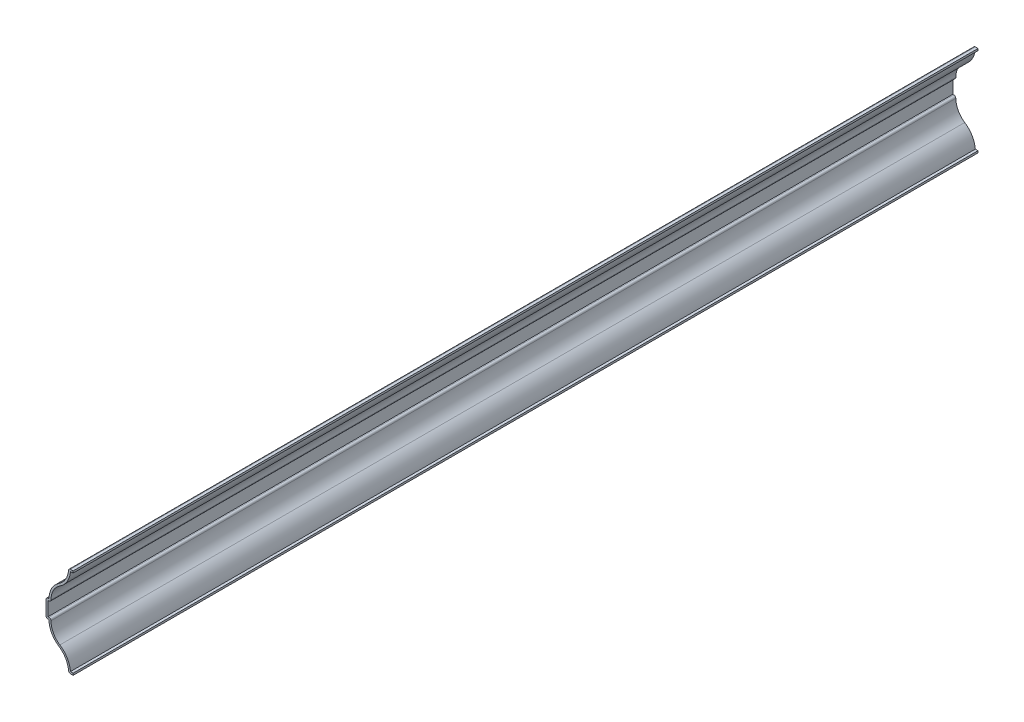
ISO-10303-21;
HEADER;
FILE_DESCRIPTION(('STEP AP214'),'2;1');
FILE_NAME('part.step','',(''),(''),'','','');
FILE_SCHEMA(('AUTOMOTIVE_DESIGN { 1 0 10303 214 1 1 1 1 }'));
ENDSEC;
DATA;
#1=APPLICATION_CONTEXT('core data for automotive mechanical design processes');
#2=APPLICATION_PROTOCOL_DEFINITION('international standard','automotive_design',2000,#1);
#3=PRODUCT_CONTEXT('',#1,'mechanical');
#4=PRODUCT('Part','Part','',(#3));
#5=PRODUCT_RELATED_PRODUCT_CATEGORY('part','',(#4));
#6=PRODUCT_DEFINITION_FORMATION('','',#4);
#7=PRODUCT_DEFINITION_CONTEXT('part definition',#1,'design');
#8=PRODUCT_DEFINITION('design','',#6,#7);
#9=PRODUCT_DEFINITION_SHAPE('','',#8);
#10=(LENGTH_UNIT() NAMED_UNIT(*) SI_UNIT(.MILLI.,.METRE.));
#11=(NAMED_UNIT(*) PLANE_ANGLE_UNIT() SI_UNIT($,.RADIAN.));
#12=(NAMED_UNIT(*) SI_UNIT($,.STERADIAN.) SOLID_ANGLE_UNIT());
#13=UNCERTAINTY_MEASURE_WITH_UNIT(LENGTH_MEASURE(1.E-05),#10,'distance_accuracy_value','');
#14=(GEOMETRIC_REPRESENTATION_CONTEXT(3) GLOBAL_UNCERTAINTY_ASSIGNED_CONTEXT((#13)) GLOBAL_UNIT_ASSIGNED_CONTEXT((#10,
#11,#12)) REPRESENTATION_CONTEXT('',''));
#15=CARTESIAN_POINT('',(0.,0.,0.));
#16=DIRECTION('',(0.,0.,1.));
#17=DIRECTION('',(1.,0.,0.));
#18=AXIS2_PLACEMENT_3D('',#15,#16,#17);
#19=CARTESIAN_POINT('',(0.,0.,-476.25));
#20=DIRECTION('',(0.,-1.,0.));
#21=DIRECTION('',(1.,0.,0.));
#22=AXIS2_PLACEMENT_3D('',#19,#20,#21);
#23=PLANE('',#22);
#24=DIRECTION('',(1.,0.,0.));
#25=VECTOR('',#24,1.);
#26=CARTESIAN_POINT('',(0.,0.,0.));
#27=LINE('',#26,#25);
#28=CARTESIAN_POINT('',(-1.4069838600404,0.,0.));
#29=VERTEX_POINT('',#28);
#30=CARTESIAN_POINT('',(0.,0.,0.));
#31=VERTEX_POINT('',#30);
#32=EDGE_CURVE('E371',#29,#31,#27,.T.);
#33=ORIENTED_EDGE('',*,*,#32,.F.);
#34=DIRECTION('',(0.,0.,1.));
#35=VECTOR('',#34,1.);
#36=CARTESIAN_POINT('',(-1.4069838600404,0.,-476.25));
#37=LINE('',#36,#35);
#38=CARTESIAN_POINT('',(-1.4069838600404,0.,-476.25));
#39=VERTEX_POINT('',#38);
#40=EDGE_CURVE('E216',#29,#39,#37,.F.);
#41=ORIENTED_EDGE('',*,*,#40,.T.);
#42=DIRECTION('',(1.,0.,0.));
#43=VECTOR('',#42,1.);
#44=CARTESIAN_POINT('',(0.,0.,-476.25));
#45=LINE('',#44,#43);
#46=CARTESIAN_POINT('',(0.,0.,-476.25));
#47=VERTEX_POINT('',#46);
#48=EDGE_CURVE('E209',#39,#47,#45,.T.);
#49=ORIENTED_EDGE('',*,*,#48,.T.);
#50=DIRECTION('',(0.,0.,1.));
#51=VECTOR('',#50,1.);
#52=CARTESIAN_POINT('',(0.,0.,-476.25));
#53=LINE('',#52,#51);
#54=EDGE_CURVE('E213',#47,#31,#53,.T.);
#55=ORIENTED_EDGE('',*,*,#54,.T.);
#56=EDGE_LOOP('',(#33,#41,#49,#55));
#57=FACE_BOUND('',#56,.T.);
#58=ADVANCED_FACE('F35',(#57),#23,.T.);
#59=CARTESIAN_POINT('',(-13.7532451923077,0.,-476.25));
#60=DIRECTION('',(0.,0.,1.));
#61=DIRECTION('',(1.,0.,0.));
#62=AXIS2_PLACEMENT_3D('',#59,#60,#61);
#63=CYLINDRICAL_SURFACE('',#62,11.3719951923077);
#64=CARTESIAN_POINT('',(-13.7532451923077,0.,-476.25));
#65=DIRECTION('',(0.,0.,-1.));
#66=DIRECTION('',(1.,0.,0.));
#67=AXIS2_PLACEMENT_3D('',#64,#65,#66);
#68=CIRCLE('',#67,11.3719951923077);
#69=CARTESIAN_POINT('',(-7.540625,9.525,-476.25));
#70=VERTEX_POINT('',#69);
#71=CARTESIAN_POINT('',(-2.41956106231221,0.932672876928384,-476.25));
#72=VERTEX_POINT('',#71);
#73=EDGE_CURVE('E233',#70,#72,#68,.T.);
#74=ORIENTED_EDGE('',*,*,#73,.T.);
#75=DIRECTION('',(0.,0.,1.));
#76=VECTOR('',#75,1.);
#77=CARTESIAN_POINT('',(-2.41956106231221,0.932672876928385,-476.25));
#78=LINE('',#77,#76);
#79=CARTESIAN_POINT('',(-2.41956106231221,0.932672876928384,0.));
#80=VERTEX_POINT('',#79);
#81=EDGE_CURVE('E242',#72,#80,#78,.T.);
#82=ORIENTED_EDGE('',*,*,#81,.T.);
#83=CARTESIAN_POINT('',(-13.7532451923077,0.,0.));
#84=DIRECTION('',(0.,0.,-1.));
#85=DIRECTION('',(1.,0.,0.));
#86=AXIS2_PLACEMENT_3D('',#83,#84,#85);
#87=CIRCLE('',#86,11.3719951923077);
#88=CARTESIAN_POINT('',(-7.540625,9.525,0.));
#89=VERTEX_POINT('',#88);
#90=EDGE_CURVE('E219',#89,#80,#87,.T.);
#91=ORIENTED_EDGE('',*,*,#90,.F.);
#92=DIRECTION('',(0.,0.,1.));
#93=VECTOR('',#92,1.);
#94=CARTESIAN_POINT('',(-7.540625,9.525,-476.25));
#95=LINE('',#94,#93);
#96=EDGE_CURVE('E246',#70,#89,#95,.T.);
#97=ORIENTED_EDGE('',*,*,#96,.F.);
#98=EDGE_LOOP('',(#74,#82,#91,#97));
#99=FACE_BOUND('',#98,.T.);
#100=ADVANCED_FACE('F448',(#99),#63,.F.);
#101=CARTESIAN_POINT('',(-1.32800480769231,19.05,-476.25));
#102=DIRECTION('',(0.,0.,1.));
#103=DIRECTION('',(1.,0.,0.));
#104=AXIS2_PLACEMENT_3D('',#101,#102,#103);
#105=CYLINDRICAL_SURFACE('',#104,11.3719951923077);
#106=CARTESIAN_POINT('',(-1.32800480769231,19.05,0.));
#107=DIRECTION('',(0.,0.,1.));
#108=DIRECTION('',(-1.,0.,0.));
#109=AXIS2_PLACEMENT_3D('',#106,#107,#108);
#110=CIRCLE('',#109,11.3719951923077);
#111=CARTESIAN_POINT('',(-12.7,19.05,0.));
#112=VERTEX_POINT('',#111);
#113=EDGE_CURVE('E325',#112,#89,#110,.T.);
#114=ORIENTED_EDGE('',*,*,#113,.F.);
#115=DIRECTION('',(0.,0.,1.));
#116=VECTOR('',#115,1.);
#117=CARTESIAN_POINT('',(-12.7,19.05,-476.25));
#118=LINE('',#117,#116);
#119=CARTESIAN_POINT('',(-12.7,19.05,-476.25));
#120=VERTEX_POINT('',#119);
#121=EDGE_CURVE('E330',#120,#112,#118,.T.);
#122=ORIENTED_EDGE('',*,*,#121,.F.);
#123=CARTESIAN_POINT('',(-1.32800480769231,19.05,-476.25));
#124=DIRECTION('',(0.,0.,1.));
#125=DIRECTION('',(-1.,0.,0.));
#126=AXIS2_PLACEMENT_3D('',#123,#124,#125);
#127=CIRCLE('',#126,11.3719951923077);
#128=EDGE_CURVE('E238',#120,#70,#127,.T.);
#129=ORIENTED_EDGE('',*,*,#128,.T.);
#130=ORIENTED_EDGE('',*,*,#96,.T.);
#131=EDGE_LOOP('',(#114,#122,#129,#130));
#132=FACE_BOUND('',#131,.T.);
#133=ADVANCED_FACE('F453',(#132),#105,.T.);
#134=CARTESIAN_POINT('',(-12.7,19.05,-476.25));
#135=DIRECTION('',(0.,-1.,0.));
#136=DIRECTION('',(0.,0.,-1.));
#137=AXIS2_PLACEMENT_3D('',#134,#135,#136);
#138=PLANE('',#137);
#139=DIRECTION('',(1.,0.,0.));
#140=VECTOR('',#139,1.);
#141=CARTESIAN_POINT('',(-12.7,19.05,0.));
#142=LINE('',#141,#140);
#143=CARTESIAN_POINT('',(-13.2715,19.05,0.));
#144=VERTEX_POINT('',#143);
#145=EDGE_CURVE('E323',#144,#112,#142,.T.);
#146=ORIENTED_EDGE('',*,*,#145,.F.);
#147=DIRECTION('',(0.,0.,1.));
#148=VECTOR('',#147,1.);
#149=CARTESIAN_POINT('',(-13.2715,19.05,-476.25));
#150=LINE('',#149,#148);
#151=CARTESIAN_POINT('',(-13.2715,19.05,-476.25));
#152=VERTEX_POINT('',#151);
#153=EDGE_CURVE('E279',#144,#152,#150,.F.);
#154=ORIENTED_EDGE('',*,*,#153,.T.);
#155=DIRECTION('',(1.,0.,0.));
#156=VECTOR('',#155,1.);
#157=CARTESIAN_POINT('',(-12.7,19.05,-476.25));
#158=LINE('',#157,#156);
#159=EDGE_CURVE('E439',#152,#120,#158,.T.);
#160=ORIENTED_EDGE('',*,*,#159,.T.);
#161=ORIENTED_EDGE('',*,*,#121,.T.);
#162=EDGE_LOOP('',(#146,#154,#160,#161));
#163=FACE_BOUND('',#162,.T.);
#164=ADVANCED_FACE('F671',(#163),#138,.T.);
#165=CARTESIAN_POINT('',(-14.2875,19.05,-476.25));
#166=DIRECTION('',(-1.,0.,0.));
#167=DIRECTION('',(0.,-1.,0.));
#168=AXIS2_PLACEMENT_3D('',#165,#166,#167);
#169=PLANE('',#168);
#170=DIRECTION('',(0.,-1.,0.));
#171=VECTOR('',#170,1.);
#172=CARTESIAN_POINT('',(-14.2875,19.05,-476.25));
#173=LINE('',#172,#171);
#174=CARTESIAN_POINT('',(-14.2875,27.559,-476.25));
#175=VERTEX_POINT('',#174);
#176=CARTESIAN_POINT('',(-14.2875,20.066,-476.25));
#177=VERTEX_POINT('',#176);
#178=EDGE_CURVE('E436',#175,#177,#173,.T.);
#179=ORIENTED_EDGE('',*,*,#178,.T.);
#180=DIRECTION('',(0.,0.,1.));
#181=VECTOR('',#180,1.);
#182=CARTESIAN_POINT('',(-14.2875,20.066,-476.25));
#183=LINE('',#182,#181);
#184=CARTESIAN_POINT('',(-14.2875,20.066,0.));
#185=VERTEX_POINT('',#184);
#186=EDGE_CURVE('E276',#177,#185,#183,.T.);
#187=ORIENTED_EDGE('',*,*,#186,.T.);
#188=DIRECTION('',(0.,-1.,0.));
#189=VECTOR('',#188,1.);
#190=CARTESIAN_POINT('',(-14.2875,19.05,0.));
#191=LINE('',#190,#189);
#192=CARTESIAN_POINT('',(-14.2875,27.559,0.));
#193=VERTEX_POINT('',#192);
#194=EDGE_CURVE('E320',#193,#185,#191,.T.);
#195=ORIENTED_EDGE('',*,*,#194,.F.);
#196=DIRECTION('',(0.,0.,1.));
#197=VECTOR('',#196,1.);
#198=CARTESIAN_POINT('',(-14.2875,27.559,-476.25));
#199=LINE('',#198,#197);
#200=EDGE_CURVE('E274',#193,#175,#199,.F.);
#201=ORIENTED_EDGE('',*,*,#200,.T.);
#202=EDGE_LOOP('',(#179,#187,#195,#201));
#203=FACE_BOUND('',#202,.T.);
#204=ADVANCED_FACE('F464',(#203),#169,.T.);
#205=CARTESIAN_POINT('',(-12.7,28.575,-476.25));
#206=DIRECTION('',(0.,1.,0.));
#207=DIRECTION('',(0.,0.,1.));
#208=AXIS2_PLACEMENT_3D('',#205,#206,#207);
#209=PLANE('',#208);
#210=DIRECTION('',(-1.,0.,0.));
#211=VECTOR('',#210,1.);
#212=CARTESIAN_POINT('',(-12.7,28.575,-476.25));
#213=LINE('',#212,#211);
#214=CARTESIAN_POINT('',(-12.7,28.575,-476.25));
#215=VERTEX_POINT('',#214);
#216=CARTESIAN_POINT('',(-13.2715,28.575,-476.25));
#217=VERTEX_POINT('',#216);
#218=EDGE_CURVE('E433',#215,#217,#213,.T.);
#219=ORIENTED_EDGE('',*,*,#218,.T.);
#220=DIRECTION('',(0.,0.,1.));
#221=VECTOR('',#220,1.);
#222=CARTESIAN_POINT('',(-13.2715,28.575,-476.25));
#223=LINE('',#222,#221);
#224=CARTESIAN_POINT('',(-13.2715,28.575,0.));
#225=VERTEX_POINT('',#224);
#226=EDGE_CURVE('E281',#217,#225,#223,.T.);
#227=ORIENTED_EDGE('',*,*,#226,.T.);
#228=DIRECTION('',(-1.,0.,0.));
#229=VECTOR('',#228,1.);
#230=CARTESIAN_POINT('',(-12.7,28.575,0.));
#231=LINE('',#230,#229);
#232=CARTESIAN_POINT('',(-12.7,28.575,0.));
#233=VERTEX_POINT('',#232);
#234=EDGE_CURVE('E317',#233,#225,#231,.T.);
#235=ORIENTED_EDGE('',*,*,#234,.F.);
#236=DIRECTION('',(0.,0.,1.));
#237=VECTOR('',#236,1.);
#238=CARTESIAN_POINT('',(-12.7,28.575,-476.25));
#239=LINE('',#238,#237);
#240=EDGE_CURVE('E333',#215,#233,#239,.T.);
#241=ORIENTED_EDGE('',*,*,#240,.F.);
#242=EDGE_LOOP('',(#219,#227,#235,#241));
#243=FACE_BOUND('',#242,.T.);
#244=ADVANCED_FACE('F473',(#243),#209,.T.);
#245=CARTESIAN_POINT('',(-1.32800480769231,28.575,-476.25));
#246=DIRECTION('',(0.,0.,1.));
#247=DIRECTION('',(1.,0.,0.));
#248=AXIS2_PLACEMENT_3D('',#245,#246,#247);
#249=CYLINDRICAL_SURFACE('',#248,11.3719951923077);
#250=CARTESIAN_POINT('',(-1.32800480769231,28.575,0.));
#251=DIRECTION('',(0.,0.,1.));
#252=DIRECTION('',(1.,0.,0.));
#253=AXIS2_PLACEMENT_3D('',#250,#251,#252);
#254=CIRCLE('',#253,11.3719951923077);
#255=CARTESIAN_POINT('',(-7.540625,38.1,0.));
#256=VERTEX_POINT('',#255);
#257=EDGE_CURVE('E309',#256,#233,#254,.T.);
#258=ORIENTED_EDGE('',*,*,#257,.F.);
#259=DIRECTION('',(0.,0.,1.));
#260=VECTOR('',#259,1.);
#261=CARTESIAN_POINT('',(-7.540625,38.1,-476.25));
#262=LINE('',#261,#260);
#263=CARTESIAN_POINT('',(-7.540625,38.1,-476.25));
#264=VERTEX_POINT('',#263);
#265=EDGE_CURVE('E335',#264,#256,#262,.T.);
#266=ORIENTED_EDGE('',*,*,#265,.F.);
#267=CARTESIAN_POINT('',(-1.32800480769231,28.575,-476.25));
#268=DIRECTION('',(0.,0.,1.));
#269=DIRECTION('',(1.,0.,0.));
#270=AXIS2_PLACEMENT_3D('',#267,#268,#269);
#271=CIRCLE('',#270,11.3719951923077);
#272=EDGE_CURVE('E430',#264,#215,#271,.T.);
#273=ORIENTED_EDGE('',*,*,#272,.T.);
#274=ORIENTED_EDGE('',*,*,#240,.T.);
#275=EDGE_LOOP('',(#258,#266,#273,#274));
#276=FACE_BOUND('',#275,.T.);
#277=ADVANCED_FACE('F480',(#276),#249,.T.);
#278=CARTESIAN_POINT('',(-13.7532451923077,47.625,-476.25));
#279=DIRECTION('',(0.,0.,1.));
#280=DIRECTION('',(1.,0.,0.));
#281=AXIS2_PLACEMENT_3D('',#278,#279,#280);
#282=CYLINDRICAL_SURFACE('',#281,11.3719951923077);
#283=CARTESIAN_POINT('',(-13.7532451923077,47.625,0.));
#284=DIRECTION('',(0.,0.,-1.));
#285=DIRECTION('',(-1.,0.,0.));
#286=AXIS2_PLACEMENT_3D('',#283,#284,#285);
#287=CIRCLE('',#286,11.3719951923077);
#288=CARTESIAN_POINT('',(-2.41956106231222,46.6923271230716,0.));
#289=VERTEX_POINT('',#288);
#290=EDGE_CURVE('E307',#289,#256,#287,.T.);
#291=ORIENTED_EDGE('',*,*,#290,.F.);
#292=DIRECTION('',(0.,0.,1.));
#293=VECTOR('',#292,1.);
#294=CARTESIAN_POINT('',(-2.41956106231221,46.6923271230716,-476.25));
#295=LINE('',#294,#293);
#296=CARTESIAN_POINT('',(-2.41956106231222,46.6923271230716,-476.25));
#297=VERTEX_POINT('',#296);
#298=EDGE_CURVE('E11',#289,#297,#295,.F.);
#299=ORIENTED_EDGE('',*,*,#298,.T.);
#300=CARTESIAN_POINT('',(-13.7532451923077,47.625,-476.25));
#301=DIRECTION('',(0.,0.,-1.));
#302=DIRECTION('',(-1.,0.,0.));
#303=AXIS2_PLACEMENT_3D('',#300,#301,#302);
#304=CIRCLE('',#303,11.3719951923077);
#305=EDGE_CURVE('E428',#297,#264,#304,.T.);
#306=ORIENTED_EDGE('',*,*,#305,.T.);
#307=ORIENTED_EDGE('',*,*,#265,.T.);
#308=EDGE_LOOP('',(#291,#299,#306,#307));
#309=FACE_BOUND('',#308,.T.);
#310=ADVANCED_FACE('F482',(#309),#282,.F.);
#311=CARTESIAN_POINT('',(0.,47.625,-476.25));
#312=DIRECTION('',(0.,1.,0.));
#313=DIRECTION('',(0.,0.,1.));
#314=AXIS2_PLACEMENT_3D('',#311,#312,#313);
#315=PLANE('',#314);
#316=DIRECTION('',(-1.,0.,0.));
#317=VECTOR('',#316,1.);
#318=CARTESIAN_POINT('',(0.,47.625,-476.25));
#319=LINE('',#318,#317);
#320=CARTESIAN_POINT('',(0.,47.625,-476.25));
#321=VERTEX_POINT('',#320);
#322=CARTESIAN_POINT('',(-1.4069838600404,47.625,-476.25));
#323=VERTEX_POINT('',#322);
#324=EDGE_CURVE('E297',#321,#323,#319,.T.);
#325=ORIENTED_EDGE('',*,*,#324,.T.);
#326=DIRECTION('',(0.,0.,1.));
#327=VECTOR('',#326,1.);
#328=CARTESIAN_POINT('',(-1.4069838600404,47.625,-476.25));
#329=LINE('',#328,#327);
#330=CARTESIAN_POINT('',(-1.4069838600404,47.625,0.));
#331=VERTEX_POINT('',#330);
#332=EDGE_CURVE('E43',#323,#331,#329,.T.);
#333=ORIENTED_EDGE('',*,*,#332,.T.);
#334=DIRECTION('',(-1.,0.,0.));
#335=VECTOR('',#334,1.);
#336=CARTESIAN_POINT('',(0.,47.625,0.));
#337=LINE('',#336,#335);
#338=CARTESIAN_POINT('',(0.,47.625,0.));
#339=VERTEX_POINT('',#338);
#340=EDGE_CURVE('E295',#339,#331,#337,.T.);
#341=ORIENTED_EDGE('',*,*,#340,.F.);
#342=DIRECTION('',(0.,0.,1.));
#343=VECTOR('',#342,1.);
#344=CARTESIAN_POINT('',(0.,47.625,-476.25));
#345=LINE('',#344,#343);
#346=EDGE_CURVE('E338',#321,#339,#345,.T.);
#347=ORIENTED_EDGE('',*,*,#346,.F.);
#348=EDGE_LOOP('',(#325,#333,#341,#347));
#349=FACE_BOUND('',#348,.T.);
#350=ADVANCED_FACE('F294',(#349),#315,.T.);
#351=CARTESIAN_POINT('',(0.,47.625,-476.25));
#352=DIRECTION('',(-1.,0.,0.));
#353=DIRECTION('',(0.,0.,1.));
#354=AXIS2_PLACEMENT_3D('',#351,#352,#353);
#355=PLANE('',#354);
#356=DIRECTION('',(0.,-1.,0.));
#357=VECTOR('',#356,1.);
#358=CARTESIAN_POINT('',(0.,47.625,0.));
#359=LINE('',#358,#357);
#360=CARTESIAN_POINT('',(0.,46.609,0.));
#361=VERTEX_POINT('',#360);
#362=EDGE_CURVE('E306',#339,#361,#359,.T.);
#363=ORIENTED_EDGE('',*,*,#362,.T.);
#364=DIRECTION('',(0.,0.,1.));
#365=VECTOR('',#364,1.);
#366=CARTESIAN_POINT('',(0.,46.609,-476.25));
#367=LINE('',#366,#365);
#368=CARTESIAN_POINT('',(0.,46.609,-476.25));
#369=VERTEX_POINT('',#368);
#370=EDGE_CURVE('E340',#369,#361,#367,.T.);
#371=ORIENTED_EDGE('',*,*,#370,.F.);
#372=DIRECTION('',(0.,-1.,0.));
#373=VECTOR('',#372,1.);
#374=CARTESIAN_POINT('',(0.,47.625,-476.25));
#375=LINE('',#374,#373);
#376=EDGE_CURVE('E425',#321,#369,#375,.T.);
#377=ORIENTED_EDGE('',*,*,#376,.F.);
#378=ORIENTED_EDGE('',*,*,#346,.T.);
#379=EDGE_LOOP('',(#363,#371,#377,#378));
#380=FACE_BOUND('',#379,.T.);
#381=ADVANCED_FACE('F627',(#380),#355,.F.);
#382=CARTESIAN_POINT('',(0.,46.609,-476.25));
#383=DIRECTION('',(0.,1.,0.));
#384=DIRECTION('',(0.,0.,1.));
#385=AXIS2_PLACEMENT_3D('',#382,#383,#384);
#386=PLANE('',#385);
#387=DIRECTION('',(1.,0.,0.));
#388=VECTOR('',#387,1.);
#389=CARTESIAN_POINT('',(0.,46.609,0.));
#390=LINE('',#389,#388);
#391=CARTESIAN_POINT('',(-1.4069838600404,46.609,0.));
#392=VERTEX_POINT('',#391);
#393=EDGE_CURVE('E311',#361,#392,#390,.F.);
#394=ORIENTED_EDGE('',*,*,#393,.T.);
#395=DIRECTION('',(0.,0.,1.));
#396=VECTOR('',#395,1.);
#397=CARTESIAN_POINT('',(-1.4069838600404,46.609,-476.25));
#398=LINE('',#397,#396);
#399=CARTESIAN_POINT('',(-1.4069838600404,46.609,-476.25));
#400=VERTEX_POINT('',#399);
#401=EDGE_CURVE('E343',#400,#392,#398,.T.);
#402=ORIENTED_EDGE('',*,*,#401,.F.);
#403=DIRECTION('',(1.,0.,0.));
#404=VECTOR('',#403,1.);
#405=CARTESIAN_POINT('',(0.,46.609,-476.25));
#406=LINE('',#405,#404);
#407=EDGE_CURVE('E423',#369,#400,#406,.F.);
#408=ORIENTED_EDGE('',*,*,#407,.F.);
#409=ORIENTED_EDGE('',*,*,#370,.T.);
#410=EDGE_LOOP('',(#394,#402,#408,#409));
#411=FACE_BOUND('',#410,.T.);
#412=ADVANCED_FACE('F388',(#411),#386,.F.);
#413=CARTESIAN_POINT('',(-13.7532451923077,47.625,-476.25));
#414=DIRECTION('',(0.,0.,1.));
#415=DIRECTION('',(1.,0.,0.));
#416=AXIS2_PLACEMENT_3D('',#413,#414,#415);
#417=CYLINDRICAL_SURFACE('',#416,12.3879951923077);
#418=CARTESIAN_POINT('',(-13.7532451923077,47.625,0.));
#419=DIRECTION('',(0.,0.,1.));
#420=DIRECTION('',(1.,0.,0.));
#421=AXIS2_PLACEMENT_3D('',#418,#419,#420);
#422=CIRCLE('',#421,12.3879951923077);
#423=CARTESIAN_POINT('',(-6.98557533557047,37.2490147651007,0.));
#424=VERTEX_POINT('',#423);
#425=EDGE_CURVE('E385',#392,#424,#422,.F.);
#426=ORIENTED_EDGE('',*,*,#425,.T.);
#427=DIRECTION('',(0.,0.,1.));
#428=VECTOR('',#427,1.);
#429=CARTESIAN_POINT('',(-6.98557533557047,37.2490147651007,-476.25));
#430=LINE('',#429,#428);
#431=CARTESIAN_POINT('',(-6.98557533557047,37.2490147651007,-476.25));
#432=VERTEX_POINT('',#431);
#433=EDGE_CURVE('E346',#432,#424,#430,.T.);
#434=ORIENTED_EDGE('',*,*,#433,.F.);
#435=CARTESIAN_POINT('',(-13.7532451923077,47.625,-476.25));
#436=DIRECTION('',(0.,0.,1.));
#437=DIRECTION('',(1.,0.,0.));
#438=AXIS2_PLACEMENT_3D('',#435,#436,#437);
#439=CIRCLE('',#438,12.3879951923077);
#440=EDGE_CURVE('E396',#400,#432,#439,.F.);
#441=ORIENTED_EDGE('',*,*,#440,.F.);
#442=ORIENTED_EDGE('',*,*,#401,.T.);
#443=EDGE_LOOP('',(#426,#434,#441,#442));
#444=FACE_BOUND('',#443,.T.);
#445=ADVANCED_FACE('F394',(#444),#417,.T.);
#446=CARTESIAN_POINT('',(-1.32800480769231,28.575,-476.25));
#447=DIRECTION('',(0.,0.,1.));
#448=DIRECTION('',(1.,0.,0.));
#449=AXIS2_PLACEMENT_3D('',#446,#447,#448);
#450=CYLINDRICAL_SURFACE('',#449,10.3559951923077);
#451=CARTESIAN_POINT('',(-1.32800480769231,28.575,0.));
#452=DIRECTION('',(0.,0.,1.));
#453=DIRECTION('',(1.,0.,0.));
#454=AXIS2_PLACEMENT_3D('',#451,#452,#453);
#455=CIRCLE('',#454,10.3559951923077);
#456=CARTESIAN_POINT('',(-11.684,28.575,0.));
#457=VERTEX_POINT('',#456);
#458=EDGE_CURVE('E382',#424,#457,#455,.T.);
#459=ORIENTED_EDGE('',*,*,#458,.T.);
#460=DIRECTION('',(0.,0.,1.));
#461=VECTOR('',#460,1.);
#462=CARTESIAN_POINT('',(-11.684,28.575,-476.25));
#463=LINE('',#462,#461);
#464=CARTESIAN_POINT('',(-11.684,28.575,-476.25));
#465=VERTEX_POINT('',#464);
#466=EDGE_CURVE('E287',#457,#465,#463,.F.);
#467=ORIENTED_EDGE('',*,*,#466,.T.);
#468=CARTESIAN_POINT('',(-1.32800480769231,28.575,-476.25));
#469=DIRECTION('',(0.,0.,1.));
#470=DIRECTION('',(1.,0.,0.));
#471=AXIS2_PLACEMENT_3D('',#468,#469,#470);
#472=CIRCLE('',#471,10.3559951923077);
#473=EDGE_CURVE('E411',#432,#465,#472,.T.);
#474=ORIENTED_EDGE('',*,*,#473,.F.);
#475=ORIENTED_EDGE('',*,*,#433,.T.);
#476=EDGE_LOOP('',(#459,#467,#474,#475));
#477=FACE_BOUND('',#476,.T.);
#478=ADVANCED_FACE('F401',(#477),#450,.F.);
#479=CARTESIAN_POINT('',(-12.7,27.559,-476.25));
#480=DIRECTION('',(0.,1.,0.));
#481=DIRECTION('',(0.,0.,1.));
#482=AXIS2_PLACEMENT_3D('',#479,#480,#481);
#483=PLANE('',#482);
#484=DIRECTION('',(1.,0.,0.));
#485=VECTOR('',#484,1.);
#486=CARTESIAN_POINT('',(-12.7,27.559,-476.25));
#487=LINE('',#486,#485);
#488=CARTESIAN_POINT('',(-12.7,27.559,-476.25));
#489=VERTEX_POINT('',#488);
#490=CARTESIAN_POINT('',(-13.2715,27.559,-476.25));
#491=VERTEX_POINT('',#490);
#492=EDGE_CURVE('E409',#489,#491,#487,.F.);
#493=ORIENTED_EDGE('',*,*,#492,.F.);
#494=DIRECTION('',(0.,0.,1.));
#495=VECTOR('',#494,1.);
#496=CARTESIAN_POINT('',(-12.7,27.559,-476.25));
#497=LINE('',#496,#495);
#498=CARTESIAN_POINT('',(-12.7,27.559,0.));
#499=VERTEX_POINT('',#498);
#500=EDGE_CURVE('E284',#489,#499,#497,.T.);
#501=ORIENTED_EDGE('',*,*,#500,.T.);
#502=DIRECTION('',(1.,0.,0.));
#503=VECTOR('',#502,1.);
#504=CARTESIAN_POINT('',(-12.7,27.559,0.));
#505=LINE('',#504,#503);
#506=CARTESIAN_POINT('',(-13.2715,27.559,0.));
#507=VERTEX_POINT('',#506);
#508=EDGE_CURVE('E380',#499,#507,#505,.F.);
#509=ORIENTED_EDGE('',*,*,#508,.T.);
#510=DIRECTION('',(0.,0.,1.));
#511=VECTOR('',#510,1.);
#512=CARTESIAN_POINT('',(-13.2715,27.559,-476.25));
#513=LINE('',#512,#511);
#514=EDGE_CURVE('E349',#491,#507,#513,.T.);
#515=ORIENTED_EDGE('',*,*,#514,.F.);
#516=EDGE_LOOP('',(#493,#501,#509,#515));
#517=FACE_BOUND('',#516,.T.);
#518=ADVANCED_FACE('F413',(#517),#483,.F.);
#519=CARTESIAN_POINT('',(-13.2715,19.05,-476.25));
#520=DIRECTION('',(-1.,0.,0.));
#521=DIRECTION('',(0.,-1.,0.));
#522=AXIS2_PLACEMENT_3D('',#519,#520,#521);
#523=PLANE('',#522);
#524=DIRECTION('',(0.,-1.,0.));
#525=VECTOR('',#524,1.);
#526=CARTESIAN_POINT('',(-13.2715,19.05,0.));
#527=LINE('',#526,#525);
#528=CARTESIAN_POINT('',(-13.2715,20.066,0.));
#529=VERTEX_POINT('',#528);
#530=EDGE_CURVE('E378',#507,#529,#527,.T.);
#531=ORIENTED_EDGE('',*,*,#530,.T.);
#532=DIRECTION('',(0.,0.,1.));
#533=VECTOR('',#532,1.);
#534=CARTESIAN_POINT('',(-13.2715,20.066,-476.25));
#535=LINE('',#534,#533);
#536=CARTESIAN_POINT('',(-13.2715,20.066,-476.25));
#537=VERTEX_POINT('',#536);
#538=EDGE_CURVE('E352',#537,#529,#535,.T.);
#539=ORIENTED_EDGE('',*,*,#538,.F.);
#540=DIRECTION('',(0.,-1.,0.));
#541=VECTOR('',#540,1.);
#542=CARTESIAN_POINT('',(-13.2715,19.05,-476.25));
#543=LINE('',#542,#541);
#544=EDGE_CURVE('E415',#491,#537,#543,.T.);
#545=ORIENTED_EDGE('',*,*,#544,.F.);
#546=ORIENTED_EDGE('',*,*,#514,.T.);
#547=EDGE_LOOP('',(#531,#539,#545,#546));
#548=FACE_BOUND('',#547,.T.);
#549=ADVANCED_FACE('F590',(#548),#523,.F.);
#550=CARTESIAN_POINT('',(-12.7,20.066,-476.25));
#551=DIRECTION('',(0.,-1.,0.));
#552=DIRECTION('',(0.,0.,-1.));
#553=AXIS2_PLACEMENT_3D('',#550,#551,#552);
#554=PLANE('',#553);
#555=DIRECTION('',(1.,0.,0.));
#556=VECTOR('',#555,1.);
#557=CARTESIAN_POINT('',(-12.7,20.066,0.));
#558=LINE('',#557,#556);
#559=CARTESIAN_POINT('',(-12.7,20.066,0.));
#560=VERTEX_POINT('',#559);
#561=EDGE_CURVE('E376',#529,#560,#558,.T.);
#562=ORIENTED_EDGE('',*,*,#561,.T.);
#563=DIRECTION('',(0.,0.,1.));
#564=VECTOR('',#563,1.);
#565=CARTESIAN_POINT('',(-12.7,20.066,-476.25));
#566=LINE('',#565,#564);
#567=CARTESIAN_POINT('',(-12.7,20.066,-476.25));
#568=VERTEX_POINT('',#567);
#569=EDGE_CURVE('E58',#560,#568,#566,.F.);
#570=ORIENTED_EDGE('',*,*,#569,.T.);
#571=DIRECTION('',(1.,0.,0.));
#572=VECTOR('',#571,1.);
#573=CARTESIAN_POINT('',(-12.7,20.066,-476.25));
#574=LINE('',#573,#572);
#575=EDGE_CURVE('E418',#537,#568,#574,.T.);
#576=ORIENTED_EDGE('',*,*,#575,.F.);
#577=ORIENTED_EDGE('',*,*,#538,.T.);
#578=EDGE_LOOP('',(#562,#570,#576,#577));
#579=FACE_BOUND('',#578,.T.);
#580=ADVANCED_FACE('F581',(#579),#554,.F.);
#581=CARTESIAN_POINT('',(-1.32800480769231,19.05,-476.25));
#582=DIRECTION('',(0.,0.,1.));
#583=DIRECTION('',(1.,0.,0.));
#584=AXIS2_PLACEMENT_3D('',#581,#582,#583);
#585=CYLINDRICAL_SURFACE('',#584,10.3559951923077);
#586=CARTESIAN_POINT('',(-1.32800480769231,19.05,-476.25));
#587=DIRECTION('',(0.,0.,1.));
#588=DIRECTION('',(1.,0.,0.));
#589=AXIS2_PLACEMENT_3D('',#586,#587,#588);
#590=CIRCLE('',#589,10.3559951923077);
#591=CARTESIAN_POINT('',(-11.684,19.05,-476.25));
#592=VERTEX_POINT('',#591);
#593=CARTESIAN_POINT('',(-6.98557533557047,10.3759852348993,-476.25));
#594=VERTEX_POINT('',#593);
#595=EDGE_CURVE('E725',#592,#594,#590,.T.);
#596=ORIENTED_EDGE('',*,*,#595,.F.);
#597=DIRECTION('',(0.,0.,1.));
#598=VECTOR('',#597,1.);
#599=CARTESIAN_POINT('',(-11.684,19.05,-476.25));
#600=LINE('',#599,#598);
#601=CARTESIAN_POINT('',(-11.684,19.05,0.));
#602=VERTEX_POINT('',#601);
#603=EDGE_CURVE('E270',#592,#602,#600,.T.);
#604=ORIENTED_EDGE('',*,*,#603,.T.);
#605=CARTESIAN_POINT('',(-1.32800480769231,19.05,0.));
#606=DIRECTION('',(0.,0.,1.));
#607=DIRECTION('',(1.,0.,0.));
#608=AXIS2_PLACEMENT_3D('',#605,#606,#607);
#609=CIRCLE('',#608,10.3559951923077);
#610=CARTESIAN_POINT('',(-6.98557533557047,10.3759852348993,0.));
#611=VERTEX_POINT('',#610);
#612=EDGE_CURVE('E369',#602,#611,#609,.T.);
#613=ORIENTED_EDGE('',*,*,#612,.T.);
#614=DIRECTION('',(0.,0.,1.));
#615=VECTOR('',#614,1.);
#616=CARTESIAN_POINT('',(-6.98557533557047,10.3759852348993,-476.25));
#617=LINE('',#616,#615);
#618=EDGE_CURVE('E355',#594,#611,#617,.T.);
#619=ORIENTED_EDGE('',*,*,#618,.F.);
#620=EDGE_LOOP('',(#596,#604,#613,#619));
#621=FACE_BOUND('',#620,.T.);
#622=ADVANCED_FACE('F573',(#621),#585,.F.);
#623=CARTESIAN_POINT('',(-13.7532451923077,0.,-476.25));
#624=DIRECTION('',(0.,0.,1.));
#625=DIRECTION('',(1.,0.,0.));
#626=AXIS2_PLACEMENT_3D('',#623,#624,#625);
#627=CYLINDRICAL_SURFACE('',#626,12.3879951923077);
#628=CARTESIAN_POINT('',(-13.7532451923077,0.,0.));
#629=DIRECTION('',(0.,0.,1.));
#630=DIRECTION('',(1.,0.,0.));
#631=AXIS2_PLACEMENT_3D('',#628,#629,#630);
#632=CIRCLE('',#631,12.3879951923077);
#633=CARTESIAN_POINT('',(-1.4069838600404,1.016,0.));
#634=VERTEX_POINT('',#633);
#635=EDGE_CURVE('E367',#611,#634,#632,.F.);
#636=ORIENTED_EDGE('',*,*,#635,.T.);
#637=DIRECTION('',(0.,0.,1.));
#638=VECTOR('',#637,1.);
#639=CARTESIAN_POINT('',(-1.4069838600404,1.016,-476.25));
#640=LINE('',#639,#638);
#641=CARTESIAN_POINT('',(-1.4069838600404,1.016,-476.25));
#642=VERTEX_POINT('',#641);
#643=EDGE_CURVE('E235',#642,#634,#640,.T.);
#644=ORIENTED_EDGE('',*,*,#643,.F.);
#645=CARTESIAN_POINT('',(-13.7532451923077,0.,-476.25));
#646=DIRECTION('',(0.,0.,1.));
#647=DIRECTION('',(1.,0.,0.));
#648=AXIS2_PLACEMENT_3D('',#645,#646,#647);
#649=CIRCLE('',#648,12.3879951923077);
#650=EDGE_CURVE('E726',#594,#642,#649,.F.);
#651=ORIENTED_EDGE('',*,*,#650,.F.);
#652=ORIENTED_EDGE('',*,*,#618,.T.);
#653=EDGE_LOOP('',(#636,#644,#651,#652));
#654=FACE_BOUND('',#653,.T.);
#655=ADVANCED_FACE('F566',(#654),#627,.T.);
#656=CARTESIAN_POINT('',(0.,1.016,-476.25));
#657=DIRECTION('',(0.,-1.,0.));
#658=DIRECTION('',(1.,0.,0.));
#659=AXIS2_PLACEMENT_3D('',#656,#657,#658);
#660=PLANE('',#659);
#661=DIRECTION('',(1.,0.,0.));
#662=VECTOR('',#661,1.);
#663=CARTESIAN_POINT('',(0.,1.016,0.));
#664=LINE('',#663,#662);
#665=CARTESIAN_POINT('',(0.,1.016,0.));
#666=VERTEX_POINT('',#665);
#667=EDGE_CURVE('E362',#634,#666,#664,.T.);
#668=ORIENTED_EDGE('',*,*,#667,.T.);
#669=DIRECTION('',(0.,0.,1.));
#670=VECTOR('',#669,1.);
#671=CARTESIAN_POINT('',(0.,1.016,-476.25));
#672=LINE('',#671,#670);
#673=CARTESIAN_POINT('',(0.,1.016,-476.25));
#674=VERTEX_POINT('',#673);
#675=EDGE_CURVE('E232',#674,#666,#672,.T.);
#676=ORIENTED_EDGE('',*,*,#675,.F.);
#677=DIRECTION('',(1.,0.,0.));
#678=VECTOR('',#677,1.);
#679=CARTESIAN_POINT('',(0.,1.016,-476.25));
#680=LINE('',#679,#678);
#681=EDGE_CURVE('E224',#642,#674,#680,.T.);
#682=ORIENTED_EDGE('',*,*,#681,.F.);
#683=ORIENTED_EDGE('',*,*,#643,.T.);
#684=EDGE_LOOP('',(#668,#676,#682,#683));
#685=FACE_BOUND('',#684,.T.);
#686=ADVANCED_FACE('F361',(#685),#660,.F.);
#687=CARTESIAN_POINT('',(0.,1.016,-476.25));
#688=DIRECTION('',(-1.,0.,0.));
#689=DIRECTION('',(0.,-1.,0.));
#690=AXIS2_PLACEMENT_3D('',#687,#688,#689);
#691=PLANE('',#690);
#692=DIRECTION('',(0.,-1.,0.));
#693=VECTOR('',#692,1.);
#694=CARTESIAN_POINT('',(0.,1.016,0.));
#695=LINE('',#694,#693);
#696=EDGE_CURVE('E231',#666,#31,#695,.T.);
#697=ORIENTED_EDGE('',*,*,#696,.T.);
#698=ORIENTED_EDGE('',*,*,#54,.F.);
#699=DIRECTION('',(0.,-1.,0.));
#700=VECTOR('',#699,1.);
#701=CARTESIAN_POINT('',(0.,1.016,-476.25));
#702=LINE('',#701,#700);
#703=EDGE_CURVE('E218',#674,#47,#702,.T.);
#704=ORIENTED_EDGE('',*,*,#703,.F.);
#705=ORIENTED_EDGE('',*,*,#675,.T.);
#706=EDGE_LOOP('',(#697,#698,#704,#705));
#707=FACE_BOUND('',#706,.T.);
#708=ADVANCED_FACE('F229',(#707),#691,.F.);
#709=CARTESIAN_POINT('',(-13.7532451923077,0.,-476.25));
#710=DIRECTION('',(0.,0.,1.));
#711=DIRECTION('',(1.,0.,0.));
#712=AXIS2_PLACEMENT_3D('',#709,#710,#711);
#713=PLANE('',#712);
#714=ORIENTED_EDGE('',*,*,#48,.F.);
#715=CARTESIAN_POINT('',(-1.4069838600404,1.016,-476.25));
#716=DIRECTION('',(0.,0.,1.));
#717=DIRECTION('',(1.,0.,0.));
#718=AXIS2_PLACEMENT_3D('',#715,#716,#717);
#719=CIRCLE('',#718,1.016);
#720=EDGE_CURVE('E268',#39,#72,#719,.F.);
#721=ORIENTED_EDGE('',*,*,#720,.T.);
#722=ORIENTED_EDGE('',*,*,#73,.F.);
#723=ORIENTED_EDGE('',*,*,#128,.F.);
#724=ORIENTED_EDGE('',*,*,#159,.F.);
#725=CARTESIAN_POINT('',(-13.2715,20.066,-476.25));
#726=DIRECTION('',(0.,0.,1.));
#727=DIRECTION('',(1.,0.,0.));
#728=AXIS2_PLACEMENT_3D('',#725,#726,#727);
#729=CIRCLE('',#728,1.016);
#730=EDGE_CURVE('E265',#152,#177,#729,.F.);
#731=ORIENTED_EDGE('',*,*,#730,.T.);
#732=ORIENTED_EDGE('',*,*,#178,.F.);
#733=CARTESIAN_POINT('',(-13.2715,27.559,-476.25));
#734=DIRECTION('',(0.,0.,1.));
#735=DIRECTION('',(1.,0.,0.));
#736=AXIS2_PLACEMENT_3D('',#733,#734,#735);
#737=CIRCLE('',#736,1.016);
#738=EDGE_CURVE('E263',#175,#217,#737,.F.);
#739=ORIENTED_EDGE('',*,*,#738,.T.);
#740=ORIENTED_EDGE('',*,*,#218,.F.);
#741=ORIENTED_EDGE('',*,*,#272,.F.);
#742=ORIENTED_EDGE('',*,*,#305,.F.);
#743=CARTESIAN_POINT('',(-1.4069838600404,46.609,-476.25));
#744=DIRECTION('',(0.,0.,1.));
#745=DIRECTION('',(1.,0.,0.));
#746=AXIS2_PLACEMENT_3D('',#743,#744,#745);
#747=CIRCLE('',#746,1.016);
#748=EDGE_CURVE('E259',#297,#323,#747,.F.);
#749=ORIENTED_EDGE('',*,*,#748,.T.);
#750=ORIENTED_EDGE('',*,*,#324,.F.);
#751=ORIENTED_EDGE('',*,*,#376,.T.);
#752=ORIENTED_EDGE('',*,*,#407,.T.);
#753=ORIENTED_EDGE('',*,*,#440,.T.);
#754=ORIENTED_EDGE('',*,*,#473,.T.);
#755=CARTESIAN_POINT('',(-12.7,28.575,-476.25));
#756=DIRECTION('',(0.,0.,1.));
#757=DIRECTION('',(1.,0.,0.));
#758=AXIS2_PLACEMENT_3D('',#755,#756,#757);
#759=CIRCLE('',#758,1.016);
#760=EDGE_CURVE('E261',#465,#489,#759,.F.);
#761=ORIENTED_EDGE('',*,*,#760,.T.);
#762=ORIENTED_EDGE('',*,*,#492,.T.);
#763=ORIENTED_EDGE('',*,*,#544,.T.);
#764=ORIENTED_EDGE('',*,*,#575,.T.);
#765=CARTESIAN_POINT('',(-12.7,19.05,-476.25));
#766=DIRECTION('',(0.,0.,1.));
#767=DIRECTION('',(1.,0.,0.));
#768=AXIS2_PLACEMENT_3D('',#765,#766,#767);
#769=CIRCLE('',#768,1.016);
#770=EDGE_CURVE('E50',#568,#592,#769,.F.);
#771=ORIENTED_EDGE('',*,*,#770,.T.);
#772=ORIENTED_EDGE('',*,*,#595,.T.);
#773=ORIENTED_EDGE('',*,*,#650,.T.);
#774=ORIENTED_EDGE('',*,*,#681,.T.);
#775=ORIENTED_EDGE('',*,*,#703,.T.);
#776=EDGE_LOOP('',(#714,#721,#722,#723,#724,#731,#732,#739,#740,#741,#742,#749,#750,#751,#752,
#753,#754,#761,#762,#763,#764,#771,#772,#773,#774,#775));
#777=FACE_BOUND('',#776,.T.);
#778=ADVANCED_FACE('F222',(#777),#713,.F.);
#779=CARTESIAN_POINT('',(-13.7532451923077,0.,0.));
#780=DIRECTION('',(0.,0.,1.));
#781=DIRECTION('',(1.,0.,0.));
#782=AXIS2_PLACEMENT_3D('',#779,#780,#781);
#783=PLANE('',#782);
#784=ORIENTED_EDGE('',*,*,#90,.T.);
#785=CARTESIAN_POINT('',(-1.4069838600404,1.016,0.));
#786=DIRECTION('',(0.,0.,1.));
#787=DIRECTION('',(1.,0.,0.));
#788=AXIS2_PLACEMENT_3D('',#785,#786,#787);
#789=CIRCLE('',#788,1.016);
#790=EDGE_CURVE('E256',#80,#29,#789,.T.);
#791=ORIENTED_EDGE('',*,*,#790,.T.);
#792=ORIENTED_EDGE('',*,*,#32,.T.);
#793=ORIENTED_EDGE('',*,*,#696,.F.);
#794=ORIENTED_EDGE('',*,*,#667,.F.);
#795=ORIENTED_EDGE('',*,*,#635,.F.);
#796=ORIENTED_EDGE('',*,*,#612,.F.);
#797=CARTESIAN_POINT('',(-12.7,19.05,0.));
#798=DIRECTION('',(0.,0.,1.));
#799=DIRECTION('',(1.,0.,0.));
#800=AXIS2_PLACEMENT_3D('',#797,#798,#799);
#801=CIRCLE('',#800,1.016);
#802=EDGE_CURVE('E254',#602,#560,#801,.T.);
#803=ORIENTED_EDGE('',*,*,#802,.T.);
#804=ORIENTED_EDGE('',*,*,#561,.F.);
#805=ORIENTED_EDGE('',*,*,#530,.F.);
#806=ORIENTED_EDGE('',*,*,#508,.F.);
#807=CARTESIAN_POINT('',(-12.7,28.575,0.));
#808=DIRECTION('',(0.,0.,1.));
#809=DIRECTION('',(1.,0.,0.));
#810=AXIS2_PLACEMENT_3D('',#807,#808,#809);
#811=CIRCLE('',#810,1.016);
#812=EDGE_CURVE('E248',#499,#457,#811,.T.);
#813=ORIENTED_EDGE('',*,*,#812,.T.);
#814=ORIENTED_EDGE('',*,*,#458,.F.);
#815=ORIENTED_EDGE('',*,*,#425,.F.);
#816=ORIENTED_EDGE('',*,*,#393,.F.);
#817=ORIENTED_EDGE('',*,*,#362,.F.);
#818=ORIENTED_EDGE('',*,*,#340,.T.);
#819=CARTESIAN_POINT('',(-1.4069838600404,46.609,0.));
#820=DIRECTION('',(0.,0.,1.));
#821=DIRECTION('',(1.,0.,0.));
#822=AXIS2_PLACEMENT_3D('',#819,#820,#821);
#823=CIRCLE('',#822,1.016);
#824=EDGE_CURVE('E245',#331,#289,#823,.T.);
#825=ORIENTED_EDGE('',*,*,#824,.T.);
#826=ORIENTED_EDGE('',*,*,#290,.T.);
#827=ORIENTED_EDGE('',*,*,#257,.T.);
#828=ORIENTED_EDGE('',*,*,#234,.T.);
#829=CARTESIAN_POINT('',(-13.2715,27.559,0.));
#830=DIRECTION('',(0.,0.,1.));
#831=DIRECTION('',(1.,0.,0.));
#832=AXIS2_PLACEMENT_3D('',#829,#830,#831);
#833=CIRCLE('',#832,1.016);
#834=EDGE_CURVE('E250',#225,#193,#833,.T.);
#835=ORIENTED_EDGE('',*,*,#834,.T.);
#836=ORIENTED_EDGE('',*,*,#194,.T.);
#837=CARTESIAN_POINT('',(-13.2715,20.066,0.));
#838=DIRECTION('',(0.,0.,1.));
#839=DIRECTION('',(1.,0.,0.));
#840=AXIS2_PLACEMENT_3D('',#837,#838,#839);
#841=CIRCLE('',#840,1.016);
#842=EDGE_CURVE('E252',#185,#144,#841,.T.);
#843=ORIENTED_EDGE('',*,*,#842,.T.);
#844=ORIENTED_EDGE('',*,*,#145,.T.);
#845=ORIENTED_EDGE('',*,*,#113,.T.);
#846=EDGE_LOOP('',(#784,#791,#792,#793,#794,#795,#796,#803,#804,#805,#806,#813,#814,#815,#816,
#817,#818,#825,#826,#827,#828,#835,#836,#843,#844,#845));
#847=FACE_BOUND('',#846,.T.);
#848=ADVANCED_FACE('F303',(#847),#783,.T.);
#849=CARTESIAN_POINT('',(-1.4069838600404,1.016,-476.25));
#850=DIRECTION('',(0.,0.,1.));
#851=DIRECTION('',(1.,0.,0.));
#852=AXIS2_PLACEMENT_3D('',#849,#850,#851);
#853=CYLINDRICAL_SURFACE('',#852,1.016);
#854=ORIENTED_EDGE('',*,*,#720,.F.);
#855=ORIENTED_EDGE('',*,*,#40,.F.);
#856=ORIENTED_EDGE('',*,*,#790,.F.);
#857=ORIENTED_EDGE('',*,*,#81,.F.);
#858=EDGE_LOOP('',(#854,#855,#856,#857));
#859=FACE_BOUND('',#858,.T.);
#860=ADVANCED_FACE('F443',(#859),#853,.T.);
#861=CARTESIAN_POINT('',(-12.7,19.05,-476.25));
#862=DIRECTION('',(0.,0.,1.));
#863=DIRECTION('',(1.,0.,0.));
#864=AXIS2_PLACEMENT_3D('',#861,#862,#863);
#865=CYLINDRICAL_SURFACE('',#864,1.016);
#866=ORIENTED_EDGE('',*,*,#770,.F.);
#867=ORIENTED_EDGE('',*,*,#569,.F.);
#868=ORIENTED_EDGE('',*,*,#802,.F.);
#869=ORIENTED_EDGE('',*,*,#603,.F.);
#870=EDGE_LOOP('',(#866,#867,#868,#869));
#871=FACE_BOUND('',#870,.T.);
#872=ADVANCED_FACE('F499',(#871),#865,.T.);
#873=CARTESIAN_POINT('',(-13.2715,20.066,-476.25));
#874=DIRECTION('',(0.,0.,1.));
#875=DIRECTION('',(1.,0.,0.));
#876=AXIS2_PLACEMENT_3D('',#873,#874,#875);
#877=CYLINDRICAL_SURFACE('',#876,1.016);
#878=ORIENTED_EDGE('',*,*,#730,.F.);
#879=ORIENTED_EDGE('',*,*,#153,.F.);
#880=ORIENTED_EDGE('',*,*,#842,.F.);
#881=ORIENTED_EDGE('',*,*,#186,.F.);
#882=EDGE_LOOP('',(#878,#879,#880,#881));
#883=FACE_BOUND('',#882,.T.);
#884=ADVANCED_FACE('F461',(#883),#877,.T.);
#885=CARTESIAN_POINT('',(-13.2715,27.559,-476.25));
#886=DIRECTION('',(0.,0.,1.));
#887=DIRECTION('',(1.,0.,0.));
#888=AXIS2_PLACEMENT_3D('',#885,#886,#887);
#889=CYLINDRICAL_SURFACE('',#888,1.016);
#890=ORIENTED_EDGE('',*,*,#738,.F.);
#891=ORIENTED_EDGE('',*,*,#200,.F.);
#892=ORIENTED_EDGE('',*,*,#834,.F.);
#893=ORIENTED_EDGE('',*,*,#226,.F.);
#894=EDGE_LOOP('',(#890,#891,#892,#893));
#895=FACE_BOUND('',#894,.T.);
#896=ADVANCED_FACE('F471',(#895),#889,.T.);
#897=CARTESIAN_POINT('',(-12.7,28.575,-476.25));
#898=DIRECTION('',(0.,0.,1.));
#899=DIRECTION('',(1.,0.,0.));
#900=AXIS2_PLACEMENT_3D('',#897,#898,#899);
#901=CYLINDRICAL_SURFACE('',#900,1.016);
#902=ORIENTED_EDGE('',*,*,#760,.F.);
#903=ORIENTED_EDGE('',*,*,#466,.F.);
#904=ORIENTED_EDGE('',*,*,#812,.F.);
#905=ORIENTED_EDGE('',*,*,#500,.F.);
#906=EDGE_LOOP('',(#902,#903,#904,#905));
#907=FACE_BOUND('',#906,.T.);
#908=ADVANCED_FACE('F406',(#907),#901,.T.);
#909=CARTESIAN_POINT('',(-1.4069838600404,46.609,-476.25));
#910=DIRECTION('',(0.,0.,1.));
#911=DIRECTION('',(1.,0.,0.));
#912=AXIS2_PLACEMENT_3D('',#909,#910,#911);
#913=CYLINDRICAL_SURFACE('',#912,1.016);
#914=ORIENTED_EDGE('',*,*,#748,.F.);
#915=ORIENTED_EDGE('',*,*,#298,.F.);
#916=ORIENTED_EDGE('',*,*,#824,.F.);
#917=ORIENTED_EDGE('',*,*,#332,.F.);
#918=EDGE_LOOP('',(#914,#915,#916,#917));
#919=FACE_BOUND('',#918,.T.);
#920=ADVANCED_FACE('F37',(#919),#913,.T.);
#921=CLOSED_SHELL('',(#58,#100,#133,#164,#204,#244,#277,#310,#350,#381,#412,#445,#478,#518,#549,
#580,#622,#655,#686,#708,#778,#848,#860,#872,#884,#896,#908,#920));
#922=MANIFOLD_SOLID_BREP('B2',#921);
#923=ADVANCED_BREP_SHAPE_REPRESENTATION('',(#18,#922),#14);
#924=SHAPE_DEFINITION_REPRESENTATION(#9,#923);
ENDSEC;
END-ISO-10303-21;
